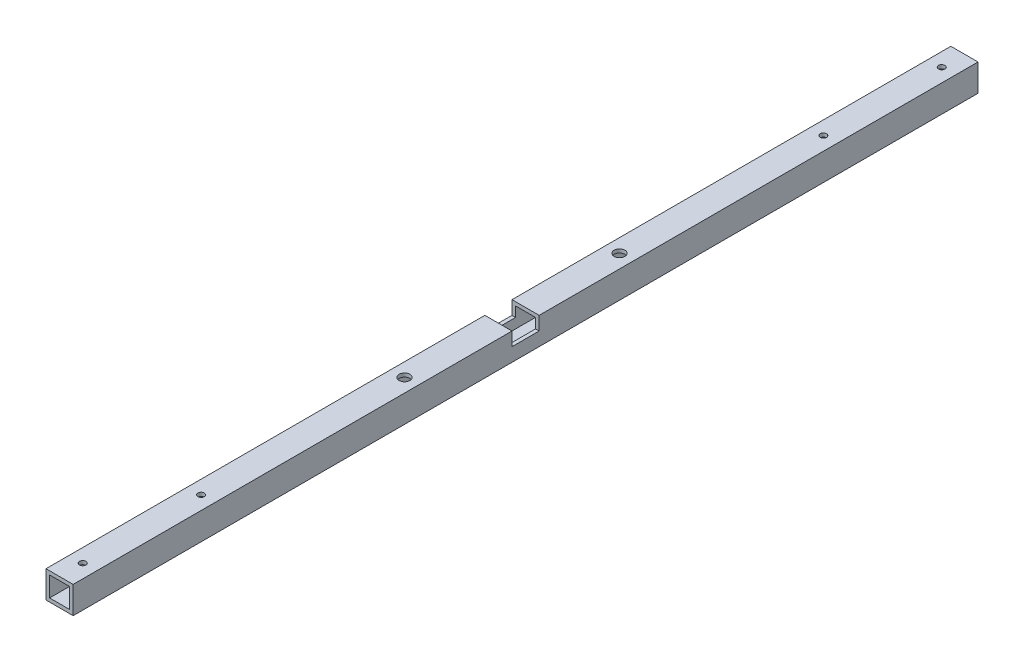
ISO-10303-21;
HEADER;
FILE_DESCRIPTION(('STEP AP214'),'2;1');
FILE_NAME('part.step','',(''),(''),'','','');
FILE_SCHEMA(('AUTOMOTIVE_DESIGN { 1 0 10303 214 1 1 1 1 }'));
ENDSEC;
DATA;
#1=APPLICATION_CONTEXT('core data for automotive mechanical design processes');
#2=APPLICATION_PROTOCOL_DEFINITION('international standard','automotive_design',2000,#1);
#3=PRODUCT_CONTEXT('',#1,'mechanical');
#4=PRODUCT('Part','Part','',(#3));
#5=PRODUCT_RELATED_PRODUCT_CATEGORY('part','',(#4));
#6=PRODUCT_DEFINITION_FORMATION('','',#4);
#7=PRODUCT_DEFINITION_CONTEXT('part definition',#1,'design');
#8=PRODUCT_DEFINITION('design','',#6,#7);
#9=PRODUCT_DEFINITION_SHAPE('','',#8);
#10=(LENGTH_UNIT() NAMED_UNIT(*) SI_UNIT(.MILLI.,.METRE.));
#11=(NAMED_UNIT(*) PLANE_ANGLE_UNIT() SI_UNIT($,.RADIAN.));
#12=(NAMED_UNIT(*) SI_UNIT($,.STERADIAN.) SOLID_ANGLE_UNIT());
#13=UNCERTAINTY_MEASURE_WITH_UNIT(LENGTH_MEASURE(1.E-05),#10,'distance_accuracy_value','');
#14=(GEOMETRIC_REPRESENTATION_CONTEXT(3) GLOBAL_UNCERTAINTY_ASSIGNED_CONTEXT((#13)) GLOBAL_UNIT_ASSIGNED_CONTEXT((#10,
#11,#12)) REPRESENTATION_CONTEXT('',''));
#15=CARTESIAN_POINT('',(0.,0.,0.));
#16=DIRECTION('',(0.,0.,1.));
#17=DIRECTION('',(1.,0.,0.));
#18=AXIS2_PLACEMENT_3D('',#15,#16,#17);
#19=CARTESIAN_POINT('',(-44.7155374715877,15.4023148117892,-0.0001));
#20=DIRECTION('',(0.,1.,0.));
#21=DIRECTION('',(0.,0.,1.));
#22=AXIS2_PLACEMENT_3D('',#19,#20,#21);
#23=PLANE('',#22);
#24=CARTESIAN_POINT('',(-40.9655374715878,15.4023148117892,95.301415190165));
#25=DIRECTION('',(0.,1.,0.));
#26=DIRECTION('',(0.,0.,1.));
#27=AXIS2_PLACEMENT_3D('',#24,#25,#26);
#28=CIRCLE('',#27,1.5);
#29=CARTESIAN_POINT('',(-40.9655374715878,15.4023148117892,96.801415190165));
#30=VERTEX_POINT('',#29);
#31=EDGE_CURVE('E289',#30,#30,#28,.T.);
#32=ORIENTED_EDGE('',*,*,#31,.F.);
#33=EDGE_LOOP('',(#32));
#34=FACE_BOUND('',#33,.T.);
#35=CARTESIAN_POINT('',(-40.9655374715877,15.4023148117887,38.9728833462074));
#36=DIRECTION('',(0.,-1.,0.));
#37=DIRECTION('',(0.,0.,-1.));
#38=AXIS2_PLACEMENT_3D('',#35,#36,#37);
#39=CIRCLE('',#38,0.889000000000001);
#40=CARTESIAN_POINT('',(-40.9655374715877,15.4023148117887,38.0838833462074));
#41=VERTEX_POINT('',#40);
#42=EDGE_CURVE('E284',#41,#41,#39,.T.);
#43=ORIENTED_EDGE('',*,*,#42,.T.);
#44=EDGE_LOOP('',(#43));
#45=FACE_BOUND('',#44,.T.);
#46=CARTESIAN_POINT('',(-40.9655374715877,15.4023148117887,6.27288334620743));
#47=DIRECTION('',(0.,-1.,0.));
#48=DIRECTION('',(0.,0.,-1.));
#49=AXIS2_PLACEMENT_3D('',#46,#47,#48);
#50=CIRCLE('',#49,0.889000000000001);
#51=CARTESIAN_POINT('',(-40.9655374715877,15.4023148117887,5.38388334620743));
#52=VERTEX_POINT('',#51);
#53=EDGE_CURVE('E279',#52,#52,#50,.T.);
#54=ORIENTED_EDGE('',*,*,#53,.T.);
#55=EDGE_LOOP('',(#54));
#56=FACE_BOUND('',#55,.T.);
#57=DIRECTION('',(-1.,0.,0.));
#58=VECTOR('',#57,1.);
#59=CARTESIAN_POINT('',(-44.7155374715877,15.4023148117892,121.2499));
#60=LINE('',#59,#58);
#61=CARTESIAN_POINT('',(-37.2155374715877,15.4023148117892,121.2499));
#62=VERTEX_POINT('',#61);
#63=CARTESIAN_POINT('',(-44.7155374715877,15.4023148117892,121.2499));
#64=VERTEX_POINT('',#63);
#65=EDGE_CURVE('E166',#62,#64,#60,.T.);
#66=ORIENTED_EDGE('',*,*,#65,.F.);
#67=DIRECTION('',(0.,0.,1.));
#68=VECTOR('',#67,1.);
#69=CARTESIAN_POINT('',(-37.2155374715877,15.4023148117892,-0.0001));
#70=LINE('',#69,#68);
#71=CARTESIAN_POINT('',(-37.2155374715877,15.4023148117892,-0.0001));
#72=VERTEX_POINT('',#71);
#73=EDGE_CURVE('E255',#72,#62,#70,.T.);
#74=ORIENTED_EDGE('',*,*,#73,.F.);
#75=DIRECTION('',(-1.,0.,0.));
#76=VECTOR('',#75,1.);
#77=CARTESIAN_POINT('',(-44.7155374715877,15.4023148117892,-0.0001));
#78=LINE('',#77,#76);
#79=CARTESIAN_POINT('',(-44.7155374715877,15.4023148117892,-0.0001));
#80=VERTEX_POINT('',#79);
#81=EDGE_CURVE('E247',#72,#80,#78,.T.);
#82=ORIENTED_EDGE('',*,*,#81,.T.);
#83=DIRECTION('',(0.,0.,1.));
#84=VECTOR('',#83,1.);
#85=CARTESIAN_POINT('',(-44.7155374715877,15.4023148117892,-0.0001));
#86=LINE('',#85,#84);
#87=EDGE_CURVE('E251',#80,#64,#86,.T.);
#88=ORIENTED_EDGE('',*,*,#87,.T.);
#89=EDGE_LOOP('',(#66,#74,#82,#88));
#90=FACE_BOUND('',#89,.T.);
#91=ADVANCED_FACE('F33',(#34,#45,#56,#90),#23,.T.);
#92=CARTESIAN_POINT('',(-38.2155374715877,14.4023148117892,-0.000100000000002876));
#93=DIRECTION('',(0.,1.,0.));
#94=DIRECTION('',(0.,0.,1.));
#95=AXIS2_PLACEMENT_3D('',#92,#93,#94);
#96=PLANE('',#95);
#97=CARTESIAN_POINT('',(-40.9655374715878,14.4023148117892,95.301415190165));
#98=DIRECTION('',(0.,1.,0.));
#99=DIRECTION('',(0.,0.,1.));
#100=AXIS2_PLACEMENT_3D('',#97,#98,#99);
#101=CIRCLE('',#100,1.5);
#102=CARTESIAN_POINT('',(-40.9655374715878,14.4023148117892,96.801415190165));
#103=VERTEX_POINT('',#102);
#104=EDGE_CURVE('E290',#103,#103,#101,.T.);
#105=ORIENTED_EDGE('',*,*,#104,.T.);
#106=EDGE_LOOP('',(#105));
#107=FACE_BOUND('',#106,.T.);
#108=CARTESIAN_POINT('',(-40.9655374715877,14.4023148117892,38.9728833462074));
#109=DIRECTION('',(0.,1.,0.));
#110=DIRECTION('',(0.,0.,1.));
#111=AXIS2_PLACEMENT_3D('',#108,#109,#110);
#112=CIRCLE('',#111,0.888999999999994);
#113=CARTESIAN_POINT('',(-40.9655374715877,14.4023148117892,39.8618833462074));
#114=VERTEX_POINT('',#113);
#115=EDGE_CURVE('E283',#114,#114,#112,.T.);
#116=ORIENTED_EDGE('',*,*,#115,.T.);
#117=EDGE_LOOP('',(#116));
#118=FACE_BOUND('',#117,.T.);
#119=CARTESIAN_POINT('',(-40.9655374715877,14.4023148117892,6.27288334620743));
#120=DIRECTION('',(0.,1.,0.));
#121=DIRECTION('',(0.,0.,1.));
#122=AXIS2_PLACEMENT_3D('',#119,#120,#121);
#123=CIRCLE('',#122,0.888999999999994);
#124=CARTESIAN_POINT('',(-40.9655374715877,14.4023148117892,7.16188334620742));
#125=VERTEX_POINT('',#124);
#126=EDGE_CURVE('E278',#125,#125,#123,.T.);
#127=ORIENTED_EDGE('',*,*,#126,.T.);
#128=EDGE_LOOP('',(#127));
#129=FACE_BOUND('',#128,.T.);
#130=DIRECTION('',(0.,0.,1.));
#131=VECTOR('',#130,1.);
#132=CARTESIAN_POINT('',(-38.2155374715877,14.4023148117892,-0.000100000000002876));
#133=LINE('',#132,#131);
#134=CARTESIAN_POINT('',(-38.2155374715877,14.4023148117892,-0.000100000000002876));
#135=VERTEX_POINT('',#134);
#136=CARTESIAN_POINT('',(-38.2155374715877,14.4023148117892,121.2499));
#137=VERTEX_POINT('',#136);
#138=EDGE_CURVE('E224',#135,#137,#133,.T.);
#139=ORIENTED_EDGE('',*,*,#138,.T.);
#140=DIRECTION('',(-1.,0.,0.));
#141=VECTOR('',#140,1.);
#142=CARTESIAN_POINT('',(-38.2155374715877,14.4023148117892,121.2499));
#143=LINE('',#142,#141);
#144=CARTESIAN_POINT('',(-43.7155374715877,14.4023148117892,121.2499));
#145=VERTEX_POINT('',#144);
#146=EDGE_CURVE('E42',#137,#145,#143,.T.);
#147=ORIENTED_EDGE('',*,*,#146,.T.);
#148=DIRECTION('',(0.,0.,1.));
#149=VECTOR('',#148,1.);
#150=CARTESIAN_POINT('',(-43.7155374715877,14.4023148117892,-0.000100000000002876));
#151=LINE('',#150,#149);
#152=CARTESIAN_POINT('',(-43.7155374715877,14.4023148117892,-0.0001));
#153=VERTEX_POINT('',#152);
#154=EDGE_CURVE('E220',#153,#145,#151,.T.);
#155=ORIENTED_EDGE('',*,*,#154,.F.);
#156=DIRECTION('',(-1.,0.,0.));
#157=VECTOR('',#156,1.);
#158=CARTESIAN_POINT('',(-38.2155374715877,14.4023148117892,-0.000100000000002876));
#159=LINE('',#158,#157);
#160=EDGE_CURVE('E194',#135,#153,#159,.T.);
#161=ORIENTED_EDGE('',*,*,#160,.F.);
#162=EDGE_LOOP('',(#139,#147,#155,#161));
#163=FACE_BOUND('',#162,.T.);
#164=ADVANCED_FACE('F364',(#107,#118,#129,#163),#96,.F.);
#165=CARTESIAN_POINT('',(-44.7155374715877,15.4023148117892,-0.0001));
#166=DIRECTION('',(-1.,0.,0.));
#167=DIRECTION('',(0.,0.,1.));
#168=AXIS2_PLACEMENT_3D('',#165,#166,#167);
#169=PLANE('',#168);
#170=DIRECTION('',(0.,1.,0.));
#171=VECTOR('',#170,1.);
#172=CARTESIAN_POINT('',(-44.7155374715877,11.6523148117892,121.2499));
#173=LINE('',#172,#171);
#174=CARTESIAN_POINT('',(-44.7155374715877,11.6523148117892,121.2499));
#175=VERTEX_POINT('',#174);
#176=EDGE_CURVE('E180',#175,#64,#173,.T.);
#177=ORIENTED_EDGE('',*,*,#176,.T.);
#178=ORIENTED_EDGE('',*,*,#87,.F.);
#179=DIRECTION('',(0.,-1.,0.));
#180=VECTOR('',#179,1.);
#181=CARTESIAN_POINT('',(-44.7155374715877,15.4023148117892,-0.0001));
#182=LINE('',#181,#180);
#183=CARTESIAN_POINT('',(-44.7155374715877,7.9023148117892,-0.0001));
#184=VERTEX_POINT('',#183);
#185=EDGE_CURVE('E238',#80,#184,#182,.T.);
#186=ORIENTED_EDGE('',*,*,#185,.T.);
#187=DIRECTION('',(0.,0.,1.));
#188=VECTOR('',#187,1.);
#189=CARTESIAN_POINT('',(-44.7155374715877,7.9023148117892,-0.0001));
#190=LINE('',#189,#188);
#191=CARTESIAN_POINT('',(-44.7155374715877,7.9023148117892,250.));
#192=VERTEX_POINT('',#191);
#193=EDGE_CURVE('E250',#184,#192,#190,.T.);
#194=ORIENTED_EDGE('',*,*,#193,.T.);
#195=DIRECTION('',(0.,-1.,0.));
#196=VECTOR('',#195,1.);
#197=CARTESIAN_POINT('',(-44.7155374715877,15.4023148117892,250.));
#198=LINE('',#197,#196);
#199=CARTESIAN_POINT('',(-44.7155374715877,15.4023148117892,250.));
#200=VERTEX_POINT('',#199);
#201=EDGE_CURVE('E217',#200,#192,#198,.T.);
#202=ORIENTED_EDGE('',*,*,#201,.F.);
#203=CARTESIAN_POINT('',(-44.7155374715877,15.4023148117892,128.7499));
#204=VERTEX_POINT('',#203);
#205=EDGE_CURVE('E170',#204,#200,#86,.T.);
#206=ORIENTED_EDGE('',*,*,#205,.F.);
#207=DIRECTION('',(0.,1.,0.));
#208=VECTOR('',#207,1.);
#209=CARTESIAN_POINT('',(-44.7155374715877,11.6523148117892,128.7499));
#210=LINE('',#209,#208);
#211=CARTESIAN_POINT('',(-44.7155374715877,11.6523148117892,128.7499));
#212=VERTEX_POINT('',#211);
#213=EDGE_CURVE('E149',#212,#204,#210,.T.);
#214=ORIENTED_EDGE('',*,*,#213,.F.);
#215=DIRECTION('',(0.,0.,1.));
#216=VECTOR('',#215,1.);
#217=CARTESIAN_POINT('',(-44.7155374715877,11.6523148117892,121.2499));
#218=LINE('',#217,#216);
#219=EDGE_CURVE('E159',#175,#212,#218,.T.);
#220=ORIENTED_EDGE('',*,*,#219,.F.);
#221=EDGE_LOOP('',(#177,#178,#186,#194,#202,#206,#214,#220));
#222=FACE_BOUND('',#221,.T.);
#223=ADVANCED_FACE('F35',(#222),#169,.T.);
#224=CARTESIAN_POINT('',(-40.9655374715878,15.4023148117892,154.698384809835));
#225=DIRECTION('',(0.,1.,0.));
#226=DIRECTION('',(0.,0.,1.));
#227=AXIS2_PLACEMENT_3D('',#224,#225,#226);
#228=CIRCLE('',#227,1.5);
#229=CARTESIAN_POINT('',(-40.9655374715878,15.4023148117892,156.198384809835));
#230=VERTEX_POINT('',#229);
#231=EDGE_CURVE('E288',#230,#230,#228,.T.);
#232=ORIENTED_EDGE('',*,*,#231,.F.);
#233=EDGE_LOOP('',(#232));
#234=FACE_BOUND('',#233,.T.);
#235=CARTESIAN_POINT('',(-40.9655374715875,15.402314811789,243.6));
#236=DIRECTION('',(0.,-1.,0.));
#237=DIRECTION('',(0.,0.,-1.));
#238=AXIS2_PLACEMENT_3D('',#235,#236,#237);
#239=CIRCLE('',#238,0.889000000000001);
#240=CARTESIAN_POINT('',(-40.9655374715875,15.402314811789,242.711));
#241=VERTEX_POINT('',#240);
#242=EDGE_CURVE('E274',#241,#241,#239,.T.);
#243=ORIENTED_EDGE('',*,*,#242,.T.);
#244=EDGE_LOOP('',(#243));
#245=FACE_BOUND('',#244,.T.);
#246=CARTESIAN_POINT('',(-40.9655374715875,15.402314811789,210.9));
#247=DIRECTION('',(0.,-1.,0.));
#248=DIRECTION('',(0.,0.,-1.));
#249=AXIS2_PLACEMENT_3D('',#246,#247,#248);
#250=CIRCLE('',#249,0.889000000000001);
#251=CARTESIAN_POINT('',(-40.9655374715875,15.402314811789,210.011));
#252=VERTEX_POINT('',#251);
#253=EDGE_CURVE('E269',#252,#252,#250,.T.);
#254=ORIENTED_EDGE('',*,*,#253,.T.);
#255=EDGE_LOOP('',(#254));
#256=FACE_BOUND('',#255,.T.);
#257=DIRECTION('',(1.,0.,0.));
#258=VECTOR('',#257,1.);
#259=CARTESIAN_POINT('',(-44.7155374715877,15.4023148117892,128.7499));
#260=LINE('',#259,#258);
#261=CARTESIAN_POINT('',(-37.2155374715877,15.4023148117892,128.7499));
#262=VERTEX_POINT('',#261);
#263=EDGE_CURVE('E337',#204,#262,#260,.T.);
#264=ORIENTED_EDGE('',*,*,#263,.F.);
#265=ORIENTED_EDGE('',*,*,#205,.T.);
#266=DIRECTION('',(-1.,0.,0.));
#267=VECTOR('',#266,1.);
#268=CARTESIAN_POINT('',(-44.7155374715877,15.4023148117892,250.));
#269=LINE('',#268,#267);
#270=CARTESIAN_POINT('',(-37.2155374715877,15.4023148117892,250.));
#271=VERTEX_POINT('',#270);
#272=EDGE_CURVE('E235',#271,#200,#269,.T.);
#273=ORIENTED_EDGE('',*,*,#272,.F.);
#274=EDGE_CURVE('E258',#262,#271,#70,.T.);
#275=ORIENTED_EDGE('',*,*,#274,.F.);
#276=EDGE_LOOP('',(#264,#265,#273,#275));
#277=FACE_BOUND('',#276,.T.);
#278=ADVANCED_FACE('F376',(#234,#245,#256,#277),#23,.T.);
#279=CARTESIAN_POINT('',(-37.2155374715877,15.4023148117892,-0.0001));
#280=DIRECTION('',(1.,0.,0.));
#281=DIRECTION('',(0.,0.,-1.));
#282=AXIS2_PLACEMENT_3D('',#279,#280,#281);
#283=PLANE('',#282);
#284=DIRECTION('',(0.,1.,0.));
#285=VECTOR('',#284,1.);
#286=CARTESIAN_POINT('',(-37.2155374715877,11.6523148117892,121.2499));
#287=LINE('',#286,#285);
#288=CARTESIAN_POINT('',(-37.2155374715877,11.6523148117892,121.2499));
#289=VERTEX_POINT('',#288);
#290=EDGE_CURVE('E173',#289,#62,#287,.T.);
#291=ORIENTED_EDGE('',*,*,#290,.F.);
#292=DIRECTION('',(0.,0.,-1.));
#293=VECTOR('',#292,1.);
#294=CARTESIAN_POINT('',(-37.2155374715877,11.6523148117892,121.2499));
#295=LINE('',#294,#293);
#296=CARTESIAN_POINT('',(-37.2155374715877,11.6523148117892,128.7499));
#297=VERTEX_POINT('',#296);
#298=EDGE_CURVE('E155',#297,#289,#295,.T.);
#299=ORIENTED_EDGE('',*,*,#298,.F.);
#300=DIRECTION('',(0.,1.,0.));
#301=VECTOR('',#300,1.);
#302=CARTESIAN_POINT('',(-37.2155374715877,11.6523148117892,128.7499));
#303=LINE('',#302,#301);
#304=EDGE_CURVE('E50',#297,#262,#303,.T.);
#305=ORIENTED_EDGE('',*,*,#304,.T.);
#306=ORIENTED_EDGE('',*,*,#274,.T.);
#307=DIRECTION('',(0.,1.,0.));
#308=VECTOR('',#307,1.);
#309=CARTESIAN_POINT('',(-37.2155374715877,15.4023148117892,250.));
#310=LINE('',#309,#308);
#311=CARTESIAN_POINT('',(-37.2155374715877,7.9023148117892,250.));
#312=VERTEX_POINT('',#311);
#313=EDGE_CURVE('E232',#312,#271,#310,.T.);
#314=ORIENTED_EDGE('',*,*,#313,.F.);
#315=DIRECTION('',(0.,0.,1.));
#316=VECTOR('',#315,1.);
#317=CARTESIAN_POINT('',(-37.2155374715877,7.9023148117892,-0.0001));
#318=LINE('',#317,#316);
#319=CARTESIAN_POINT('',(-37.2155374715877,7.9023148117892,-0.0001));
#320=VERTEX_POINT('',#319);
#321=EDGE_CURVE('E259',#320,#312,#318,.T.);
#322=ORIENTED_EDGE('',*,*,#321,.F.);
#323=DIRECTION('',(0.,1.,0.));
#324=VECTOR('',#323,1.);
#325=CARTESIAN_POINT('',(-37.2155374715877,15.4023148117892,-0.0001));
#326=LINE('',#325,#324);
#327=EDGE_CURVE('E244',#320,#72,#326,.T.);
#328=ORIENTED_EDGE('',*,*,#327,.T.);
#329=ORIENTED_EDGE('',*,*,#73,.T.);
#330=EDGE_LOOP('',(#291,#299,#305,#306,#314,#322,#328,#329));
#331=FACE_BOUND('',#330,.T.);
#332=ADVANCED_FACE('F350',(#331),#283,.T.);
#333=CARTESIAN_POINT('',(-44.7155374715877,7.9023148117892,-0.0001));
#334=DIRECTION('',(0.,-1.,0.));
#335=DIRECTION('',(0.,0.,-1.));
#336=AXIS2_PLACEMENT_3D('',#333,#334,#335);
#337=PLANE('',#336);
#338=CARTESIAN_POINT('',(-40.9655374715876,7.9023148117892,95.3014151901652));
#339=DIRECTION('',(0.,-1.,0.));
#340=DIRECTION('',(0.,0.,-1.));
#341=AXIS2_PLACEMENT_3D('',#338,#339,#340);
#342=CIRCLE('',#341,1.5);
#343=CARTESIAN_POINT('',(-40.9655374715876,7.9023148117892,93.8014151901652));
#344=VERTEX_POINT('',#343);
#345=EDGE_CURVE('E295',#344,#344,#342,.T.);
#346=ORIENTED_EDGE('',*,*,#345,.F.);
#347=EDGE_LOOP('',(#346));
#348=FACE_BOUND('',#347,.T.);
#349=CARTESIAN_POINT('',(-40.9655374715876,7.9023148117892,154.698384809835));
#350=DIRECTION('',(0.,-1.,0.));
#351=DIRECTION('',(0.,0.,-1.));
#352=AXIS2_PLACEMENT_3D('',#349,#350,#351);
#353=CIRCLE('',#352,1.5);
#354=CARTESIAN_POINT('',(-40.9655374715876,7.9023148117892,153.198384809835));
#355=VERTEX_POINT('',#354);
#356=EDGE_CURVE('E292',#355,#355,#353,.T.);
#357=ORIENTED_EDGE('',*,*,#356,.F.);
#358=EDGE_LOOP('',(#357));
#359=FACE_BOUND('',#358,.T.);
#360=CARTESIAN_POINT('',(-40.9655374715877,7.9023148117892,38.9728833462074));
#361=DIRECTION('',(0.,-1.,0.));
#362=DIRECTION('',(0.,0.,-1.));
#363=AXIS2_PLACEMENT_3D('',#360,#361,#362);
#364=CIRCLE('',#363,0.888999999999987);
#365=CARTESIAN_POINT('',(-40.9655374715877,7.9023148117892,38.0838833462075));
#366=VERTEX_POINT('',#365);
#367=EDGE_CURVE('E310',#366,#366,#364,.T.);
#368=ORIENTED_EDGE('',*,*,#367,.F.);
#369=EDGE_LOOP('',(#368));
#370=FACE_BOUND('',#369,.T.);
#371=CARTESIAN_POINT('',(-40.9655374715877,7.9023148117892,6.27288334620743));
#372=DIRECTION('',(0.,-1.,0.));
#373=DIRECTION('',(0.,0.,-1.));
#374=AXIS2_PLACEMENT_3D('',#371,#372,#373);
#375=CIRCLE('',#374,0.888999999999987);
#376=CARTESIAN_POINT('',(-40.9655374715877,7.9023148117892,5.38388334620744));
#377=VERTEX_POINT('',#376);
#378=EDGE_CURVE('E317',#377,#377,#375,.T.);
#379=ORIENTED_EDGE('',*,*,#378,.F.);
#380=EDGE_LOOP('',(#379));
#381=FACE_BOUND('',#380,.T.);
#382=CARTESIAN_POINT('',(-40.9655374715875,7.9023148117892,243.6));
#383=DIRECTION('',(0.,-1.,0.));
#384=DIRECTION('',(0.,0.,-1.));
#385=AXIS2_PLACEMENT_3D('',#382,#383,#384);
#386=CIRCLE('',#385,0.888999999999987);
#387=CARTESIAN_POINT('',(-40.9655374715875,7.9023148117892,242.711));
#388=VERTEX_POINT('',#387);
#389=EDGE_CURVE('E324',#388,#388,#386,.T.);
#390=ORIENTED_EDGE('',*,*,#389,.F.);
#391=EDGE_LOOP('',(#390));
#392=FACE_BOUND('',#391,.T.);
#393=CARTESIAN_POINT('',(-40.9655374715875,7.9023148117892,210.9));
#394=DIRECTION('',(0.,-1.,0.));
#395=DIRECTION('',(0.,0.,-1.));
#396=AXIS2_PLACEMENT_3D('',#393,#394,#395);
#397=CIRCLE('',#396,0.888999999999987);
#398=CARTESIAN_POINT('',(-40.9655374715875,7.9023148117892,210.011));
#399=VERTEX_POINT('',#398);
#400=EDGE_CURVE('E331',#399,#399,#397,.T.);
#401=ORIENTED_EDGE('',*,*,#400,.F.);
#402=EDGE_LOOP('',(#401));
#403=FACE_BOUND('',#402,.T.);
#404=ORIENTED_EDGE('',*,*,#321,.T.);
#405=DIRECTION('',(1.,0.,0.));
#406=VECTOR('',#405,1.);
#407=CARTESIAN_POINT('',(-44.7155374715877,7.9023148117892,250.));
#408=LINE('',#407,#406);
#409=EDGE_CURVE('E229',#192,#312,#408,.T.);
#410=ORIENTED_EDGE('',*,*,#409,.F.);
#411=ORIENTED_EDGE('',*,*,#193,.F.);
#412=DIRECTION('',(1.,0.,0.));
#413=VECTOR('',#412,1.);
#414=CARTESIAN_POINT('',(-44.7155374715877,7.9023148117892,-0.0001));
#415=LINE('',#414,#413);
#416=EDGE_CURVE('E241',#184,#320,#415,.T.);
#417=ORIENTED_EDGE('',*,*,#416,.T.);
#418=EDGE_LOOP('',(#404,#410,#411,#417));
#419=FACE_BOUND('',#418,.T.);
#420=ADVANCED_FACE('F380',(#348,#359,#370,#381,#392,#403,#419),#337,.T.);
#421=CARTESIAN_POINT('',(-44.7155374715877,7.9023148117892,-0.0001));
#422=DIRECTION('',(0.,0.,1.));
#423=DIRECTION('',(1.,0.,0.));
#424=AXIS2_PLACEMENT_3D('',#421,#422,#423);
#425=PLANE('',#424);
#426=DIRECTION('',(1.,0.,0.));
#427=VECTOR('',#426,1.);
#428=CARTESIAN_POINT('',(-38.2155374715877,8.9023148117892,-0.000100000000002876));
#429=LINE('',#428,#427);
#430=CARTESIAN_POINT('',(-43.7155374715877,8.9023148117892,-0.000100000000002876));
#431=VERTEX_POINT('',#430);
#432=CARTESIAN_POINT('',(-38.2155374715877,8.9023148117892,-0.000100000000002876));
#433=VERTEX_POINT('',#432);
#434=EDGE_CURVE('E201',#431,#433,#429,.T.);
#435=ORIENTED_EDGE('',*,*,#434,.T.);
#436=DIRECTION('',(0.,1.,0.));
#437=VECTOR('',#436,1.);
#438=CARTESIAN_POINT('',(-38.2155374715877,8.9023148117892,-0.000100000000002876));
#439=LINE('',#438,#437);
#440=EDGE_CURVE('E191',#433,#135,#439,.T.);
#441=ORIENTED_EDGE('',*,*,#440,.T.);
#442=ORIENTED_EDGE('',*,*,#160,.T.);
#443=DIRECTION('',(0.,-1.,0.));
#444=VECTOR('',#443,1.);
#445=CARTESIAN_POINT('',(-43.7155374715877,8.9023148117892,-0.000100000000002876));
#446=LINE('',#445,#444);
#447=EDGE_CURVE('E198',#153,#431,#446,.T.);
#448=ORIENTED_EDGE('',*,*,#447,.T.);
#449=EDGE_LOOP('',(#435,#441,#442,#448));
#450=FACE_BOUND('',#449,.T.);
#451=ORIENTED_EDGE('',*,*,#185,.F.);
#452=ORIENTED_EDGE('',*,*,#81,.F.);
#453=ORIENTED_EDGE('',*,*,#327,.F.);
#454=ORIENTED_EDGE('',*,*,#416,.F.);
#455=EDGE_LOOP('',(#451,#452,#453,#454));
#456=FACE_BOUND('',#455,.T.);
#457=ADVANCED_FACE('F357',(#450,#456),#425,.F.);
#458=CARTESIAN_POINT('',(-44.7155374715877,7.9023148117892,250.));
#459=DIRECTION('',(0.,0.,1.));
#460=DIRECTION('',(1.,0.,0.));
#461=AXIS2_PLACEMENT_3D('',#458,#459,#460);
#462=PLANE('',#461);
#463=DIRECTION('',(0.,1.,0.));
#464=VECTOR('',#463,1.);
#465=CARTESIAN_POINT('',(-38.2155374715877,8.9023148117892,250.));
#466=LINE('',#465,#464);
#467=CARTESIAN_POINT('',(-38.2155374715877,8.9023148117892,250.));
#468=VERTEX_POINT('',#467);
#469=CARTESIAN_POINT('',(-38.2155374715877,14.4023148117892,250.));
#470=VERTEX_POINT('',#469);
#471=EDGE_CURVE('E190',#468,#470,#466,.T.);
#472=ORIENTED_EDGE('',*,*,#471,.F.);
#473=DIRECTION('',(1.,0.,0.));
#474=VECTOR('',#473,1.);
#475=CARTESIAN_POINT('',(-38.2155374715877,8.9023148117892,250.));
#476=LINE('',#475,#474);
#477=CARTESIAN_POINT('',(-43.7155374715877,8.9023148117892,250.));
#478=VERTEX_POINT('',#477);
#479=EDGE_CURVE('E195',#478,#468,#476,.T.);
#480=ORIENTED_EDGE('',*,*,#479,.F.);
#481=DIRECTION('',(0.,-1.,0.));
#482=VECTOR('',#481,1.);
#483=CARTESIAN_POINT('',(-43.7155374715877,8.9023148117892,250.));
#484=LINE('',#483,#482);
#485=CARTESIAN_POINT('',(-43.7155374715877,14.4023148117892,250.));
#486=VERTEX_POINT('',#485);
#487=EDGE_CURVE('E210',#486,#478,#484,.T.);
#488=ORIENTED_EDGE('',*,*,#487,.F.);
#489=DIRECTION('',(-1.,0.,0.));
#490=VECTOR('',#489,1.);
#491=CARTESIAN_POINT('',(-38.2155374715877,14.4023148117892,250.));
#492=LINE('',#491,#490);
#493=EDGE_CURVE('E207',#470,#486,#492,.T.);
#494=ORIENTED_EDGE('',*,*,#493,.F.);
#495=EDGE_LOOP('',(#472,#480,#488,#494));
#496=FACE_BOUND('',#495,.T.);
#497=ORIENTED_EDGE('',*,*,#201,.T.);
#498=ORIENTED_EDGE('',*,*,#409,.T.);
#499=ORIENTED_EDGE('',*,*,#313,.T.);
#500=ORIENTED_EDGE('',*,*,#272,.T.);
#501=EDGE_LOOP('',(#497,#498,#499,#500));
#502=FACE_BOUND('',#501,.T.);
#503=ADVANCED_FACE('F378',(#496,#502),#462,.T.);
#504=CARTESIAN_POINT('',(-38.2155374715877,8.9023148117892,-0.000100000000002876));
#505=DIRECTION('',(1.,0.,0.));
#506=DIRECTION('',(0.,0.,-1.));
#507=AXIS2_PLACEMENT_3D('',#504,#505,#506);
#508=PLANE('',#507);
#509=DIRECTION('',(0.,0.,1.));
#510=VECTOR('',#509,1.);
#511=CARTESIAN_POINT('',(-38.2155374715877,11.6523148117892,-0.000100000000002876));
#512=LINE('',#511,#510);
#513=CARTESIAN_POINT('',(-38.2155374715877,11.6523148117892,121.2499));
#514=VERTEX_POINT('',#513);
#515=CARTESIAN_POINT('',(-38.2155374715877,11.6523148117892,128.7499));
#516=VERTEX_POINT('',#515);
#517=EDGE_CURVE('E188',#514,#516,#512,.T.);
#518=ORIENTED_EDGE('',*,*,#517,.F.);
#519=DIRECTION('',(0.,1.,0.));
#520=VECTOR('',#519,1.);
#521=CARTESIAN_POINT('',(-38.2155374715877,8.9023148117892,121.2499));
#522=LINE('',#521,#520);
#523=EDGE_CURVE('E185',#514,#137,#522,.T.);
#524=ORIENTED_EDGE('',*,*,#523,.T.);
#525=ORIENTED_EDGE('',*,*,#138,.F.);
#526=ORIENTED_EDGE('',*,*,#440,.F.);
#527=DIRECTION('',(0.,0.,1.));
#528=VECTOR('',#527,1.);
#529=CARTESIAN_POINT('',(-38.2155374715877,8.9023148117892,-0.000100000000002876));
#530=LINE('',#529,#528);
#531=EDGE_CURVE('E215',#433,#468,#530,.T.);
#532=ORIENTED_EDGE('',*,*,#531,.T.);
#533=ORIENTED_EDGE('',*,*,#471,.T.);
#534=CARTESIAN_POINT('',(-38.2155374715877,14.4023148117892,128.7499));
#535=VERTEX_POINT('',#534);
#536=EDGE_CURVE('E204',#535,#470,#133,.T.);
#537=ORIENTED_EDGE('',*,*,#536,.F.);
#538=DIRECTION('',(0.,-1.,0.));
#539=VECTOR('',#538,1.);
#540=CARTESIAN_POINT('',(-38.2155374715877,8.9023148117892,128.7499));
#541=LINE('',#540,#539);
#542=EDGE_CURVE('E56',#535,#516,#541,.T.);
#543=ORIENTED_EDGE('',*,*,#542,.T.);
#544=EDGE_LOOP('',(#518,#524,#525,#526,#532,#533,#537,#543));
#545=FACE_BOUND('',#544,.T.);
#546=ADVANCED_FACE('F370',(#545),#508,.F.);
#547=CARTESIAN_POINT('',(-38.2155374715877,8.9023148117892,-0.000100000000002876));
#548=DIRECTION('',(0.,-1.,0.));
#549=DIRECTION('',(0.,0.,-1.));
#550=AXIS2_PLACEMENT_3D('',#547,#548,#549);
#551=PLANE('',#550);
#552=CARTESIAN_POINT('',(-40.9655374715876,8.9023148117892,95.3014151901652));
#553=DIRECTION('',(0.,-1.,0.));
#554=DIRECTION('',(0.,0.,-1.));
#555=AXIS2_PLACEMENT_3D('',#552,#553,#554);
#556=CIRCLE('',#555,1.5);
#557=CARTESIAN_POINT('',(-40.9655374715876,8.9023148117892,93.8014151901652));
#558=VERTEX_POINT('',#557);
#559=EDGE_CURVE('E37',#558,#558,#556,.T.);
#560=ORIENTED_EDGE('',*,*,#559,.T.);
#561=EDGE_LOOP('',(#560));
#562=FACE_BOUND('',#561,.T.);
#563=CARTESIAN_POINT('',(-40.9655374715876,8.9023148117892,154.698384809835));
#564=DIRECTION('',(0.,-1.,0.));
#565=DIRECTION('',(0.,0.,-1.));
#566=AXIS2_PLACEMENT_3D('',#563,#564,#565);
#567=CIRCLE('',#566,1.5);
#568=CARTESIAN_POINT('',(-40.9655374715876,8.9023148117892,153.198384809835));
#569=VERTEX_POINT('',#568);
#570=EDGE_CURVE('E293',#569,#569,#567,.T.);
#571=ORIENTED_EDGE('',*,*,#570,.T.);
#572=EDGE_LOOP('',(#571));
#573=FACE_BOUND('',#572,.T.);
#574=CARTESIAN_POINT('',(-40.9655374715877,8.9023148117892,38.9728833462074));
#575=DIRECTION('',(0.,-1.,0.));
#576=DIRECTION('',(0.,0.,-1.));
#577=AXIS2_PLACEMENT_3D('',#574,#575,#576);
#578=CIRCLE('',#577,0.888999999999994);
#579=CARTESIAN_POINT('',(-40.9655374715877,8.9023148117892,38.0838833462074));
#580=VERTEX_POINT('',#579);
#581=EDGE_CURVE('E280',#580,#580,#578,.T.);
#582=ORIENTED_EDGE('',*,*,#581,.T.);
#583=EDGE_LOOP('',(#582));
#584=FACE_BOUND('',#583,.T.);
#585=CARTESIAN_POINT('',(-40.9655374715877,8.9023148117892,6.27288334620743));
#586=DIRECTION('',(0.,-1.,0.));
#587=DIRECTION('',(0.,0.,-1.));
#588=AXIS2_PLACEMENT_3D('',#585,#586,#587);
#589=CIRCLE('',#588,0.888999999999994);
#590=CARTESIAN_POINT('',(-40.9655374715877,8.9023148117892,5.38388334620744));
#591=VERTEX_POINT('',#590);
#592=EDGE_CURVE('E275',#591,#591,#589,.T.);
#593=ORIENTED_EDGE('',*,*,#592,.T.);
#594=EDGE_LOOP('',(#593));
#595=FACE_BOUND('',#594,.T.);
#596=CARTESIAN_POINT('',(-40.9655374715875,8.9023148117892,243.6));
#597=DIRECTION('',(0.,-1.,0.));
#598=DIRECTION('',(0.,0.,-1.));
#599=AXIS2_PLACEMENT_3D('',#596,#597,#598);
#600=CIRCLE('',#599,0.888999999999994);
#601=CARTESIAN_POINT('',(-40.9655374715875,8.9023148117892,242.711));
#602=VERTEX_POINT('',#601);
#603=EDGE_CURVE('E273',#602,#602,#600,.T.);
#604=ORIENTED_EDGE('',*,*,#603,.T.);
#605=EDGE_LOOP('',(#604));
#606=FACE_BOUND('',#605,.T.);
#607=CARTESIAN_POINT('',(-40.9655374715875,8.9023148117892,210.9));
#608=DIRECTION('',(0.,-1.,0.));
#609=DIRECTION('',(0.,0.,-1.));
#610=AXIS2_PLACEMENT_3D('',#607,#608,#609);
#611=CIRCLE('',#610,0.888999999999994);
#612=CARTESIAN_POINT('',(-40.9655374715875,8.9023148117892,210.011));
#613=VERTEX_POINT('',#612);
#614=EDGE_CURVE('E268',#613,#613,#611,.T.);
#615=ORIENTED_EDGE('',*,*,#614,.T.);
#616=EDGE_LOOP('',(#615));
#617=FACE_BOUND('',#616,.T.);
#618=ORIENTED_EDGE('',*,*,#479,.T.);
#619=ORIENTED_EDGE('',*,*,#531,.F.);
#620=ORIENTED_EDGE('',*,*,#434,.F.);
#621=DIRECTION('',(0.,0.,1.));
#622=VECTOR('',#621,1.);
#623=CARTESIAN_POINT('',(-43.7155374715877,8.9023148117892,-0.000100000000002876));
#624=LINE('',#623,#622);
#625=EDGE_CURVE('E218',#431,#478,#624,.T.);
#626=ORIENTED_EDGE('',*,*,#625,.T.);
#627=EDGE_LOOP('',(#618,#619,#620,#626));
#628=FACE_BOUND('',#627,.T.);
#629=ADVANCED_FACE('F430',(#562,#573,#584,#595,#606,#617,#628),#551,.F.);
#630=CARTESIAN_POINT('',(-43.7155374715877,8.9023148117892,-0.000100000000002876));
#631=DIRECTION('',(-1.,0.,0.));
#632=DIRECTION('',(0.,0.,1.));
#633=AXIS2_PLACEMENT_3D('',#630,#631,#632);
#634=PLANE('',#633);
#635=ORIENTED_EDGE('',*,*,#154,.T.);
#636=DIRECTION('',(0.,-1.,0.));
#637=VECTOR('',#636,1.);
#638=CARTESIAN_POINT('',(-43.7155374715877,8.9023148117892,121.2499));
#639=LINE('',#638,#637);
#640=CARTESIAN_POINT('',(-43.7155374715877,11.6523148117892,121.2499));
#641=VERTEX_POINT('',#640);
#642=EDGE_CURVE('E182',#145,#641,#639,.T.);
#643=ORIENTED_EDGE('',*,*,#642,.T.);
#644=DIRECTION('',(0.,0.,-1.));
#645=VECTOR('',#644,1.);
#646=CARTESIAN_POINT('',(-43.7155374715877,11.6523148117892,-0.000100000000002876));
#647=LINE('',#646,#645);
#648=CARTESIAN_POINT('',(-43.7155374715877,11.6523148117892,128.7499));
#649=VERTEX_POINT('',#648);
#650=EDGE_CURVE('E11',#649,#641,#647,.T.);
#651=ORIENTED_EDGE('',*,*,#650,.F.);
#652=DIRECTION('',(0.,1.,0.));
#653=VECTOR('',#652,1.);
#654=CARTESIAN_POINT('',(-43.7155374715877,8.9023148117892,128.7499));
#655=LINE('',#654,#653);
#656=CARTESIAN_POINT('',(-43.7155374715877,14.4023148117892,128.7499));
#657=VERTEX_POINT('',#656);
#658=EDGE_CURVE('E152',#649,#657,#655,.T.);
#659=ORIENTED_EDGE('',*,*,#658,.T.);
#660=EDGE_CURVE('E223',#657,#486,#151,.T.);
#661=ORIENTED_EDGE('',*,*,#660,.T.);
#662=ORIENTED_EDGE('',*,*,#487,.T.);
#663=ORIENTED_EDGE('',*,*,#625,.F.);
#664=ORIENTED_EDGE('',*,*,#447,.F.);
#665=EDGE_LOOP('',(#635,#643,#651,#659,#661,#662,#663,#664));
#666=FACE_BOUND('',#665,.T.);
#667=ADVANCED_FACE('F360',(#666),#634,.F.);
#668=CARTESIAN_POINT('',(-40.9655374715878,14.4023148117892,154.698384809835));
#669=DIRECTION('',(0.,1.,0.));
#670=DIRECTION('',(0.,0.,1.));
#671=AXIS2_PLACEMENT_3D('',#668,#669,#670);
#672=CIRCLE('',#671,1.5);
#673=CARTESIAN_POINT('',(-40.9655374715878,14.4023148117892,156.198384809835));
#674=VERTEX_POINT('',#673);
#675=EDGE_CURVE('E285',#674,#674,#672,.T.);
#676=ORIENTED_EDGE('',*,*,#675,.T.);
#677=EDGE_LOOP('',(#676));
#678=FACE_BOUND('',#677,.T.);
#679=CARTESIAN_POINT('',(-40.9655374715875,14.4023148117892,243.6));
#680=DIRECTION('',(0.,1.,0.));
#681=DIRECTION('',(0.,0.,1.));
#682=AXIS2_PLACEMENT_3D('',#679,#680,#681);
#683=CIRCLE('',#682,0.888999999999994);
#684=CARTESIAN_POINT('',(-40.9655374715875,14.4023148117892,244.489));
#685=VERTEX_POINT('',#684);
#686=EDGE_CURVE('E270',#685,#685,#683,.T.);
#687=ORIENTED_EDGE('',*,*,#686,.T.);
#688=EDGE_LOOP('',(#687));
#689=FACE_BOUND('',#688,.T.);
#690=CARTESIAN_POINT('',(-40.9655374715875,14.4023148117892,210.9));
#691=DIRECTION('',(0.,1.,0.));
#692=DIRECTION('',(0.,0.,1.));
#693=AXIS2_PLACEMENT_3D('',#690,#691,#692);
#694=CIRCLE('',#693,0.888999999999994);
#695=CARTESIAN_POINT('',(-40.9655374715875,14.4023148117892,211.789));
#696=VERTEX_POINT('',#695);
#697=EDGE_CURVE('E265',#696,#696,#694,.T.);
#698=ORIENTED_EDGE('',*,*,#697,.T.);
#699=EDGE_LOOP('',(#698));
#700=FACE_BOUND('',#699,.T.);
#701=ORIENTED_EDGE('',*,*,#660,.F.);
#702=DIRECTION('',(1.,0.,0.));
#703=VECTOR('',#702,1.);
#704=CARTESIAN_POINT('',(-38.2155374715877,14.4023148117892,128.7499));
#705=LINE('',#704,#703);
#706=EDGE_CURVE('E254',#657,#535,#705,.T.);
#707=ORIENTED_EDGE('',*,*,#706,.T.);
#708=ORIENTED_EDGE('',*,*,#536,.T.);
#709=ORIENTED_EDGE('',*,*,#493,.T.);
#710=EDGE_LOOP('',(#701,#707,#708,#709));
#711=FACE_BOUND('',#710,.T.);
#712=ADVANCED_FACE('F398',(#678,#689,#700,#711),#96,.F.);
#713=CARTESIAN_POINT('',(-44.7155374715877,11.6523148117892,128.7499));
#714=DIRECTION('',(0.,1.,0.));
#715=DIRECTION('',(0.,0.,1.));
#716=AXIS2_PLACEMENT_3D('',#713,#714,#715);
#717=PLANE('',#716);
#718=ORIENTED_EDGE('',*,*,#517,.T.);
#719=DIRECTION('',(1.,0.,0.));
#720=VECTOR('',#719,1.);
#721=CARTESIAN_POINT('',(-44.7155374715877,11.6523148117892,128.7499));
#722=LINE('',#721,#720);
#723=EDGE_CURVE('E156',#516,#297,#722,.T.);
#724=ORIENTED_EDGE('',*,*,#723,.T.);
#725=ORIENTED_EDGE('',*,*,#298,.T.);
#726=DIRECTION('',(-1.,0.,0.));
#727=VECTOR('',#726,1.);
#728=CARTESIAN_POINT('',(-44.7155374715877,11.6523148117892,121.2499));
#729=LINE('',#728,#727);
#730=EDGE_CURVE('E171',#289,#514,#729,.T.);
#731=ORIENTED_EDGE('',*,*,#730,.T.);
#732=EDGE_LOOP('',(#718,#724,#725,#731));
#733=FACE_BOUND('',#732,.T.);
#734=ADVANCED_FACE('F372',(#733),#717,.T.);
#735=ORIENTED_EDGE('',*,*,#650,.T.);
#736=EDGE_CURVE('E162',#641,#175,#729,.T.);
#737=ORIENTED_EDGE('',*,*,#736,.T.);
#738=ORIENTED_EDGE('',*,*,#219,.T.);
#739=EDGE_CURVE('E145',#212,#649,#722,.T.);
#740=ORIENTED_EDGE('',*,*,#739,.T.);
#741=EDGE_LOOP('',(#735,#737,#738,#740));
#742=FACE_BOUND('',#741,.T.);
#743=ADVANCED_FACE('F160',(#742),#717,.T.);
#744=CARTESIAN_POINT('',(-44.7155374715877,11.6523148117892,121.2499));
#745=DIRECTION('',(0.,0.,-1.));
#746=DIRECTION('',(-1.,0.,0.));
#747=AXIS2_PLACEMENT_3D('',#744,#745,#746);
#748=PLANE('',#747);
#749=ORIENTED_EDGE('',*,*,#730,.F.);
#750=ORIENTED_EDGE('',*,*,#290,.T.);
#751=ORIENTED_EDGE('',*,*,#65,.T.);
#752=ORIENTED_EDGE('',*,*,#176,.F.);
#753=ORIENTED_EDGE('',*,*,#736,.F.);
#754=ORIENTED_EDGE('',*,*,#642,.F.);
#755=ORIENTED_EDGE('',*,*,#146,.F.);
#756=ORIENTED_EDGE('',*,*,#523,.F.);
#757=EDGE_LOOP('',(#749,#750,#751,#752,#753,#754,#755,#756));
#758=FACE_BOUND('',#757,.T.);
#759=ADVANCED_FACE('F346',(#758),#748,.F.);
#760=CARTESIAN_POINT('',(-44.7155374715877,11.6523148117892,128.7499));
#761=DIRECTION('',(0.,0.,1.));
#762=DIRECTION('',(1.,0.,0.));
#763=AXIS2_PLACEMENT_3D('',#760,#761,#762);
#764=PLANE('',#763);
#765=ORIENTED_EDGE('',*,*,#706,.F.);
#766=ORIENTED_EDGE('',*,*,#658,.F.);
#767=ORIENTED_EDGE('',*,*,#739,.F.);
#768=ORIENTED_EDGE('',*,*,#213,.T.);
#769=ORIENTED_EDGE('',*,*,#263,.T.);
#770=ORIENTED_EDGE('',*,*,#304,.F.);
#771=ORIENTED_EDGE('',*,*,#723,.F.);
#772=ORIENTED_EDGE('',*,*,#542,.F.);
#773=EDGE_LOOP('',(#765,#766,#767,#768,#769,#770,#771,#772));
#774=FACE_BOUND('',#773,.T.);
#775=ADVANCED_FACE('F147',(#774),#764,.F.);
#776=CARTESIAN_POINT('',(-40.9655374715875,7.9023148117892,210.9));
#777=DIRECTION('',(0.,-1.,0.));
#778=DIRECTION('',(0.,0.,-1.));
#779=AXIS2_PLACEMENT_3D('',#776,#777,#778);
#780=CYLINDRICAL_SURFACE('',#779,0.888999999999994);
#781=ORIENTED_EDGE('',*,*,#253,.F.);
#782=EDGE_LOOP('',(#781));
#783=FACE_BOUND('',#782,.T.);
#784=ORIENTED_EDGE('',*,*,#697,.F.);
#785=EDGE_LOOP('',(#784));
#786=FACE_BOUND('',#785,.T.);
#787=ADVANCED_FACE('F412',(#783,#786),#780,.F.);
#788=ORIENTED_EDGE('',*,*,#400,.T.);
#789=EDGE_LOOP('',(#788));
#790=FACE_BOUND('',#789,.T.);
#791=ORIENTED_EDGE('',*,*,#614,.F.);
#792=EDGE_LOOP('',(#791));
#793=FACE_BOUND('',#792,.T.);
#794=ADVANCED_FACE('F415',(#790,#793),#780,.F.);
#795=CARTESIAN_POINT('',(-40.9655374715875,7.9023148117892,243.6));
#796=DIRECTION('',(0.,-1.,0.));
#797=DIRECTION('',(0.,0.,-1.));
#798=AXIS2_PLACEMENT_3D('',#795,#796,#797);
#799=CYLINDRICAL_SURFACE('',#798,0.888999999999994);
#800=ORIENTED_EDGE('',*,*,#242,.F.);
#801=EDGE_LOOP('',(#800));
#802=FACE_BOUND('',#801,.T.);
#803=ORIENTED_EDGE('',*,*,#686,.F.);
#804=EDGE_LOOP('',(#803));
#805=FACE_BOUND('',#804,.T.);
#806=ADVANCED_FACE('F509',(#802,#805),#799,.F.);
#807=ORIENTED_EDGE('',*,*,#389,.T.);
#808=EDGE_LOOP('',(#807));
#809=FACE_BOUND('',#808,.T.);
#810=ORIENTED_EDGE('',*,*,#603,.F.);
#811=EDGE_LOOP('',(#810));
#812=FACE_BOUND('',#811,.T.);
#813=ADVANCED_FACE('F518',(#809,#812),#799,.F.);
#814=CARTESIAN_POINT('',(-40.9655374715877,7.9023148117892,6.27288334620743));
#815=DIRECTION('',(0.,-1.,0.));
#816=DIRECTION('',(0.,0.,-1.));
#817=AXIS2_PLACEMENT_3D('',#814,#815,#816);
#818=CYLINDRICAL_SURFACE('',#817,0.888999999999994);
#819=ORIENTED_EDGE('',*,*,#378,.T.);
#820=EDGE_LOOP('',(#819));
#821=FACE_BOUND('',#820,.T.);
#822=ORIENTED_EDGE('',*,*,#592,.F.);
#823=EDGE_LOOP('',(#822));
#824=FACE_BOUND('',#823,.T.);
#825=ADVANCED_FACE('F528',(#821,#824),#818,.F.);
#826=ORIENTED_EDGE('',*,*,#53,.F.);
#827=EDGE_LOOP('',(#826));
#828=FACE_BOUND('',#827,.T.);
#829=ORIENTED_EDGE('',*,*,#126,.F.);
#830=EDGE_LOOP('',(#829));
#831=FACE_BOUND('',#830,.T.);
#832=ADVANCED_FACE('F537',(#828,#831),#818,.F.);
#833=CARTESIAN_POINT('',(-40.9655374715877,7.9023148117892,38.9728833462074));
#834=DIRECTION('',(0.,-1.,0.));
#835=DIRECTION('',(0.,0.,-1.));
#836=AXIS2_PLACEMENT_3D('',#833,#834,#835);
#837=CYLINDRICAL_SURFACE('',#836,0.888999999999994);
#838=ORIENTED_EDGE('',*,*,#367,.T.);
#839=EDGE_LOOP('',(#838));
#840=FACE_BOUND('',#839,.T.);
#841=ORIENTED_EDGE('',*,*,#581,.F.);
#842=EDGE_LOOP('',(#841));
#843=FACE_BOUND('',#842,.T.);
#844=ADVANCED_FACE('F547',(#840,#843),#837,.F.);
#845=ORIENTED_EDGE('',*,*,#42,.F.);
#846=EDGE_LOOP('',(#845));
#847=FACE_BOUND('',#846,.T.);
#848=ORIENTED_EDGE('',*,*,#115,.F.);
#849=EDGE_LOOP('',(#848));
#850=FACE_BOUND('',#849,.T.);
#851=ADVANCED_FACE('F556',(#847,#850),#837,.F.);
#852=CARTESIAN_POINT('',(-40.9655374715878,13.9023148117892,154.698384809835));
#853=DIRECTION('',(0.,1.,0.));
#854=DIRECTION('',(-1.,0.,0.));
#855=AXIS2_PLACEMENT_3D('',#852,#853,#854);
#856=CYLINDRICAL_SURFACE('',#855,1.5);
#857=ORIENTED_EDGE('',*,*,#231,.T.);
#858=EDGE_LOOP('',(#857));
#859=FACE_BOUND('',#858,.T.);
#860=ORIENTED_EDGE('',*,*,#675,.F.);
#861=EDGE_LOOP('',(#860));
#862=FACE_BOUND('',#861,.T.);
#863=ADVANCED_FACE('F565',(#859,#862),#856,.F.);
#864=CARTESIAN_POINT('',(-40.9655374715878,13.9023148117892,95.301415190165));
#865=DIRECTION('',(0.,1.,0.));
#866=DIRECTION('',(-1.,0.,0.));
#867=AXIS2_PLACEMENT_3D('',#864,#865,#866);
#868=CYLINDRICAL_SURFACE('',#867,1.5);
#869=ORIENTED_EDGE('',*,*,#31,.T.);
#870=EDGE_LOOP('',(#869));
#871=FACE_BOUND('',#870,.T.);
#872=ORIENTED_EDGE('',*,*,#104,.F.);
#873=EDGE_LOOP('',(#872));
#874=FACE_BOUND('',#873,.T.);
#875=ADVANCED_FACE('F594',(#871,#874),#868,.F.);
#876=CARTESIAN_POINT('',(-40.9655374715876,9.4023148117892,154.698384809835));
#877=DIRECTION('',(0.,-1.,0.));
#878=DIRECTION('',(1.,0.,0.));
#879=AXIS2_PLACEMENT_3D('',#876,#877,#878);
#880=CYLINDRICAL_SURFACE('',#879,1.5);
#881=ORIENTED_EDGE('',*,*,#356,.T.);
#882=EDGE_LOOP('',(#881));
#883=FACE_BOUND('',#882,.T.);
#884=ORIENTED_EDGE('',*,*,#570,.F.);
#885=EDGE_LOOP('',(#884));
#886=FACE_BOUND('',#885,.T.);
#887=ADVANCED_FACE('F603',(#883,#886),#880,.F.);
#888=CARTESIAN_POINT('',(-40.9655374715876,9.4023148117892,95.3014151901652));
#889=DIRECTION('',(0.,-1.,0.));
#890=DIRECTION('',(1.,0.,0.));
#891=AXIS2_PLACEMENT_3D('',#888,#889,#890);
#892=CYLINDRICAL_SURFACE('',#891,1.5);
#893=ORIENTED_EDGE('',*,*,#345,.T.);
#894=EDGE_LOOP('',(#893));
#895=FACE_BOUND('',#894,.T.);
#896=ORIENTED_EDGE('',*,*,#559,.F.);
#897=EDGE_LOOP('',(#896));
#898=FACE_BOUND('',#897,.T.);
#899=ADVANCED_FACE('F622',(#895,#898),#892,.F.);
#900=CLOSED_SHELL('',(#91,#164,#223,#278,#332,#420,#457,#503,#546,#629,#667,#712,#734,#743,#759,
#775,#787,#794,#806,#813,#825,#832,#844,#851,#863,#875,#887,#899));
#901=MANIFOLD_SOLID_BREP('B2',#900);
#902=ADVANCED_BREP_SHAPE_REPRESENTATION('',(#18,#901),#14);
#903=SHAPE_DEFINITION_REPRESENTATION(#9,#902);
ENDSEC;
END-ISO-10303-21;
